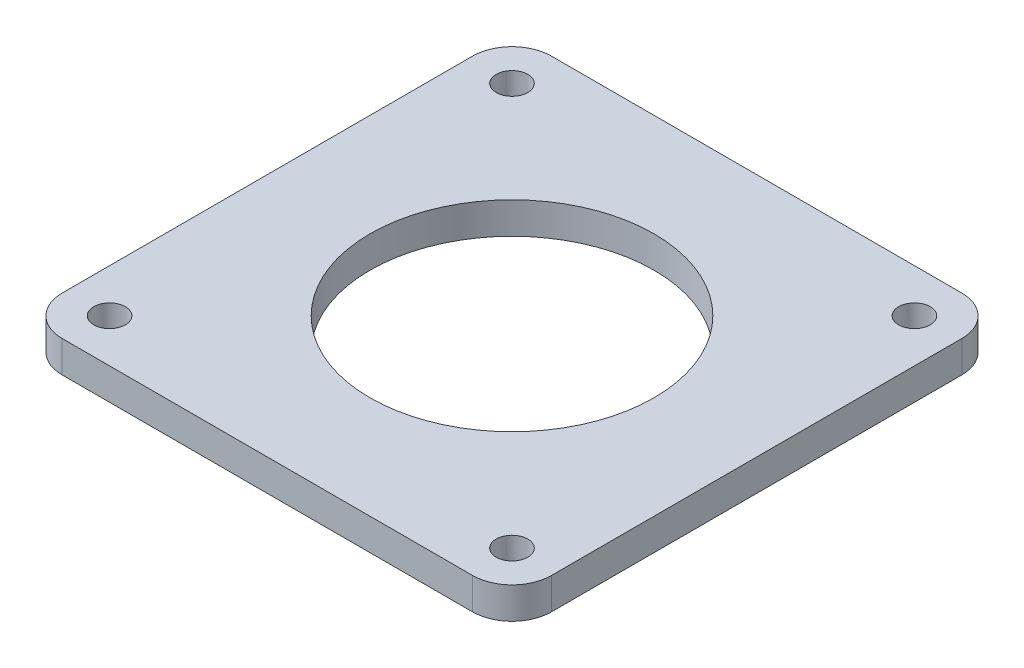
ISO-10303-21;
HEADER;
FILE_DESCRIPTION(('STEP AP214'),'2;1');
FILE_NAME('part.step','',(''),(''),'','','');
FILE_SCHEMA(('AUTOMOTIVE_DESIGN { 1 0 10303 214 1 1 1 1 }'));
ENDSEC;
DATA;
#1=APPLICATION_CONTEXT('core data for automotive mechanical design processes');
#2=APPLICATION_PROTOCOL_DEFINITION('international standard','automotive_design',2000,#1);
#3=PRODUCT_CONTEXT('',#1,'mechanical');
#4=PRODUCT('Part','Part','',(#3));
#5=PRODUCT_RELATED_PRODUCT_CATEGORY('part','',(#4));
#6=PRODUCT_DEFINITION_FORMATION('','',#4);
#7=PRODUCT_DEFINITION_CONTEXT('part definition',#1,'design');
#8=PRODUCT_DEFINITION('design','',#6,#7);
#9=PRODUCT_DEFINITION_SHAPE('','',#8);
#10=(LENGTH_UNIT() NAMED_UNIT(*) SI_UNIT(.MILLI.,.METRE.));
#11=(NAMED_UNIT(*) PLANE_ANGLE_UNIT() SI_UNIT($,.RADIAN.));
#12=(NAMED_UNIT(*) SI_UNIT($,.STERADIAN.) SOLID_ANGLE_UNIT());
#13=UNCERTAINTY_MEASURE_WITH_UNIT(LENGTH_MEASURE(1.E-05),#10,'distance_accuracy_value','');
#14=(GEOMETRIC_REPRESENTATION_CONTEXT(3) GLOBAL_UNCERTAINTY_ASSIGNED_CONTEXT((#13)) GLOBAL_UNIT_ASSIGNED_CONTEXT((#10,
#11,#12)) REPRESENTATION_CONTEXT('',''));
#15=CARTESIAN_POINT('',(0.,0.,0.));
#16=DIRECTION('',(0.,0.,1.));
#17=DIRECTION('',(1.,0.,0.));
#18=AXIS2_PLACEMENT_3D('',#15,#16,#17);
#19=CARTESIAN_POINT('',(0.,4.,31.));
#20=DIRECTION('',(0.,0.,-1.));
#21=DIRECTION('',(-1.,0.,0.));
#22=AXIS2_PLACEMENT_3D('',#19,#20,#21);
#23=PLANE('',#22);
#24=DIRECTION('',(1.,0.,0.));
#25=VECTOR('',#24,1.);
#26=CARTESIAN_POINT('',(0.,4.,31.));
#27=LINE('',#26,#25);
#28=CARTESIAN_POINT('',(-26.,4.,31.));
#29=VERTEX_POINT('',#28);
#30=CARTESIAN_POINT('',(26.,4.,31.));
#31=VERTEX_POINT('',#30);
#32=EDGE_CURVE('E124',#29,#31,#27,.T.);
#33=ORIENTED_EDGE('',*,*,#32,.F.);
#34=DIRECTION('',(0.,-1.,0.));
#35=VECTOR('',#34,1.);
#36=CARTESIAN_POINT('',(-26.,0.,31.));
#37=LINE('',#36,#35);
#38=CARTESIAN_POINT('',(-26.,0.,31.));
#39=VERTEX_POINT('',#38);
#40=EDGE_CURVE('E109',#29,#39,#37,.T.);
#41=ORIENTED_EDGE('',*,*,#40,.T.);
#42=DIRECTION('',(1.,0.,0.));
#43=VECTOR('',#42,1.);
#44=CARTESIAN_POINT('',(0.,0.,31.));
#45=LINE('',#44,#43);
#46=CARTESIAN_POINT('',(26.,0.,31.));
#47=VERTEX_POINT('',#46);
#48=EDGE_CURVE('E121',#39,#47,#45,.T.);
#49=ORIENTED_EDGE('',*,*,#48,.T.);
#50=DIRECTION('',(0.,-1.,0.));
#51=VECTOR('',#50,1.);
#52=CARTESIAN_POINT('',(26.,4.,31.));
#53=LINE('',#52,#51);
#54=EDGE_CURVE('E126',#47,#31,#53,.F.);
#55=ORIENTED_EDGE('',*,*,#54,.T.);
#56=EDGE_LOOP('',(#33,#41,#49,#55));
#57=FACE_BOUND('',#56,.T.);
#58=ADVANCED_FACE('F39',(#57),#23,.F.);
#59=CARTESIAN_POINT('',(31.,4.,0.));
#60=DIRECTION('',(-1.,0.,0.));
#61=DIRECTION('',(0.,0.,1.));
#62=AXIS2_PLACEMENT_3D('',#59,#60,#61);
#63=PLANE('',#62);
#64=DIRECTION('',(0.,0.,-1.));
#65=VECTOR('',#64,1.);
#66=CARTESIAN_POINT('',(31.,0.,0.));
#67=LINE('',#66,#65);
#68=CARTESIAN_POINT('',(31.,0.,26.));
#69=VERTEX_POINT('',#68);
#70=CARTESIAN_POINT('',(31.,0.,-26.));
#71=VERTEX_POINT('',#70);
#72=EDGE_CURVE('E131',#69,#71,#67,.T.);
#73=ORIENTED_EDGE('',*,*,#72,.T.);
#74=DIRECTION('',(0.,-1.,0.));
#75=VECTOR('',#74,1.);
#76=CARTESIAN_POINT('',(31.,4.,-26.));
#77=LINE('',#76,#75);
#78=CARTESIAN_POINT('',(31.,4.,-26.));
#79=VERTEX_POINT('',#78);
#80=EDGE_CURVE('E11',#71,#79,#77,.F.);
#81=ORIENTED_EDGE('',*,*,#80,.T.);
#82=DIRECTION('',(0.,0.,-1.));
#83=VECTOR('',#82,1.);
#84=CARTESIAN_POINT('',(31.,4.,0.));
#85=LINE('',#84,#83);
#86=CARTESIAN_POINT('',(31.,4.,26.));
#87=VERTEX_POINT('',#86);
#88=EDGE_CURVE('E182',#87,#79,#85,.T.);
#89=ORIENTED_EDGE('',*,*,#88,.F.);
#90=DIRECTION('',(0.,-1.,0.));
#91=VECTOR('',#90,1.);
#92=CARTESIAN_POINT('',(31.,4.,26.));
#93=LINE('',#92,#91);
#94=EDGE_CURVE('E47',#87,#69,#93,.T.);
#95=ORIENTED_EDGE('',*,*,#94,.T.);
#96=EDGE_LOOP('',(#73,#81,#89,#95));
#97=FACE_BOUND('',#96,.T.);
#98=ADVANCED_FACE('F180',(#97),#63,.F.);
#99=CARTESIAN_POINT('',(0.,4.,-31.));
#100=DIRECTION('',(0.,0.,-1.));
#101=DIRECTION('',(-1.,0.,0.));
#102=AXIS2_PLACEMENT_3D('',#99,#100,#101);
#103=PLANE('',#102);
#104=DIRECTION('',(1.,0.,0.));
#105=VECTOR('',#104,1.);
#106=CARTESIAN_POINT('',(0.,4.,-31.));
#107=LINE('',#106,#105);
#108=CARTESIAN_POINT('',(-26.,4.,-31.));
#109=VERTEX_POINT('',#108);
#110=CARTESIAN_POINT('',(26.,4.,-31.));
#111=VERTEX_POINT('',#110);
#112=EDGE_CURVE('E189',#109,#111,#107,.T.);
#113=ORIENTED_EDGE('',*,*,#112,.T.);
#114=DIRECTION('',(0.,-1.,0.));
#115=VECTOR('',#114,1.);
#116=CARTESIAN_POINT('',(26.,0.,-31.));
#117=LINE('',#116,#115);
#118=CARTESIAN_POINT('',(26.,0.,-31.));
#119=VERTEX_POINT('',#118);
#120=EDGE_CURVE('E174',#111,#119,#117,.T.);
#121=ORIENTED_EDGE('',*,*,#120,.T.);
#122=DIRECTION('',(1.,0.,0.));
#123=VECTOR('',#122,1.);
#124=CARTESIAN_POINT('',(0.,0.,-31.));
#125=LINE('',#124,#123);
#126=CARTESIAN_POINT('',(-26.,0.,-31.));
#127=VERTEX_POINT('',#126);
#128=EDGE_CURVE('E135',#127,#119,#125,.T.);
#129=ORIENTED_EDGE('',*,*,#128,.F.);
#130=DIRECTION('',(0.,-1.,0.));
#131=VECTOR('',#130,1.);
#132=CARTESIAN_POINT('',(-26.,4.,-31.));
#133=LINE('',#132,#131);
#134=EDGE_CURVE('E61',#127,#109,#133,.F.);
#135=ORIENTED_EDGE('',*,*,#134,.T.);
#136=EDGE_LOOP('',(#113,#121,#129,#135));
#137=FACE_BOUND('',#136,.T.);
#138=ADVANCED_FACE('F188',(#137),#103,.T.);
#139=CARTESIAN_POINT('',(25.5,4.,25.5));
#140=DIRECTION('',(0.,-1.,0.));
#141=DIRECTION('',(0.,0.,-1.));
#142=AXIS2_PLACEMENT_3D('',#139,#140,#141);
#143=CYLINDRICAL_SURFACE('',#142,2.);
#144=CARTESIAN_POINT('',(25.5,4.,25.5));
#145=DIRECTION('',(0.,1.,0.));
#146=DIRECTION('',(0.,0.,1.));
#147=AXIS2_PLACEMENT_3D('',#144,#145,#146);
#148=CIRCLE('',#147,2.);
#149=CARTESIAN_POINT('',(25.5,4.,27.5));
#150=VERTEX_POINT('',#149);
#151=EDGE_CURVE('E194',#150,#150,#148,.T.);
#152=ORIENTED_EDGE('',*,*,#151,.T.);
#153=EDGE_LOOP('',(#152));
#154=FACE_BOUND('',#153,.T.);
#155=CARTESIAN_POINT('',(25.5,0.,25.5));
#156=DIRECTION('',(0.,1.,0.));
#157=DIRECTION('',(0.,0.,1.));
#158=AXIS2_PLACEMENT_3D('',#155,#156,#157);
#159=CIRCLE('',#158,2.);
#160=CARTESIAN_POINT('',(25.5,0.,27.5));
#161=VERTEX_POINT('',#160);
#162=EDGE_CURVE('E146',#161,#161,#159,.T.);
#163=ORIENTED_EDGE('',*,*,#162,.F.);
#164=EDGE_LOOP('',(#163));
#165=FACE_BOUND('',#164,.T.);
#166=ADVANCED_FACE('F227',(#154,#165),#143,.F.);
#167=CARTESIAN_POINT('',(-31.,4.,0.));
#168=DIRECTION('',(-1.,0.,0.));
#169=DIRECTION('',(0.,0.,1.));
#170=AXIS2_PLACEMENT_3D('',#167,#168,#169);
#171=PLANE('',#170);
#172=DIRECTION('',(0.,0.,-1.));
#173=VECTOR('',#172,1.);
#174=CARTESIAN_POINT('',(-31.,0.,0.));
#175=LINE('',#174,#173);
#176=CARTESIAN_POINT('',(-31.,0.,26.));
#177=VERTEX_POINT('',#176);
#178=CARTESIAN_POINT('',(-31.,0.,-26.));
#179=VERTEX_POINT('',#178);
#180=EDGE_CURVE('E144',#177,#179,#175,.T.);
#181=ORIENTED_EDGE('',*,*,#180,.F.);
#182=DIRECTION('',(0.,-1.,0.));
#183=VECTOR('',#182,1.);
#184=CARTESIAN_POINT('',(-31.,4.,26.));
#185=LINE('',#184,#183);
#186=CARTESIAN_POINT('',(-31.,4.,26.));
#187=VERTEX_POINT('',#186);
#188=EDGE_CURVE('E110',#177,#187,#185,.F.);
#189=ORIENTED_EDGE('',*,*,#188,.T.);
#190=DIRECTION('',(0.,0.,-1.));
#191=VECTOR('',#190,1.);
#192=CARTESIAN_POINT('',(-31.,4.,0.));
#193=LINE('',#192,#191);
#194=CARTESIAN_POINT('',(-31.,4.,-26.));
#195=VERTEX_POINT('',#194);
#196=EDGE_CURVE('E191',#187,#195,#193,.T.);
#197=ORIENTED_EDGE('',*,*,#196,.T.);
#198=DIRECTION('',(0.,-1.,0.));
#199=VECTOR('',#198,1.);
#200=CARTESIAN_POINT('',(-31.,4.,-26.));
#201=LINE('',#200,#199);
#202=EDGE_CURVE('E115',#195,#179,#201,.T.);
#203=ORIENTED_EDGE('',*,*,#202,.T.);
#204=EDGE_LOOP('',(#181,#189,#197,#203));
#205=FACE_BOUND('',#204,.T.);
#206=ADVANCED_FACE('F217',(#205),#171,.T.);
#207=CARTESIAN_POINT('',(-25.5,4.,-25.5));
#208=DIRECTION('',(0.,-1.,0.));
#209=DIRECTION('',(0.,0.,-1.));
#210=AXIS2_PLACEMENT_3D('',#207,#208,#209);
#211=CYLINDRICAL_SURFACE('',#210,2.);
#212=CARTESIAN_POINT('',(-25.5,4.,-25.5));
#213=DIRECTION('',(0.,1.,0.));
#214=DIRECTION('',(0.,0.,1.));
#215=AXIS2_PLACEMENT_3D('',#212,#213,#214);
#216=CIRCLE('',#215,2.);
#217=CARTESIAN_POINT('',(-25.5,4.,-23.5));
#218=VERTEX_POINT('',#217);
#219=EDGE_CURVE('E263',#218,#218,#216,.T.);
#220=ORIENTED_EDGE('',*,*,#219,.T.);
#221=EDGE_LOOP('',(#220));
#222=FACE_BOUND('',#221,.T.);
#223=CARTESIAN_POINT('',(-25.5,0.,-25.5));
#224=DIRECTION('',(0.,1.,0.));
#225=DIRECTION('',(0.,0.,1.));
#226=AXIS2_PLACEMENT_3D('',#223,#224,#225);
#227=CIRCLE('',#226,2.);
#228=CARTESIAN_POINT('',(-25.5,0.,-23.5));
#229=VERTEX_POINT('',#228);
#230=EDGE_CURVE('E132',#229,#229,#227,.T.);
#231=ORIENTED_EDGE('',*,*,#230,.F.);
#232=EDGE_LOOP('',(#231));
#233=FACE_BOUND('',#232,.T.);
#234=ADVANCED_FACE('F215',(#222,#233),#211,.F.);
#235=CARTESIAN_POINT('',(25.5,4.,-25.5));
#236=DIRECTION('',(0.,-1.,0.));
#237=DIRECTION('',(0.,0.,-1.));
#238=AXIS2_PLACEMENT_3D('',#235,#236,#237);
#239=CYLINDRICAL_SURFACE('',#238,2.);
#240=CARTESIAN_POINT('',(25.5,4.,-25.5));
#241=DIRECTION('',(0.,1.,0.));
#242=DIRECTION('',(0.,0.,1.));
#243=AXIS2_PLACEMENT_3D('',#240,#241,#242);
#244=CIRCLE('',#243,2.);
#245=CARTESIAN_POINT('',(25.5,4.,-23.5));
#246=VERTEX_POINT('',#245);
#247=EDGE_CURVE('E152',#246,#246,#244,.F.);
#248=ORIENTED_EDGE('',*,*,#247,.F.);
#249=EDGE_LOOP('',(#248));
#250=FACE_BOUND('',#249,.T.);
#251=CARTESIAN_POINT('',(25.5,0.,-25.5));
#252=DIRECTION('',(0.,1.,0.));
#253=DIRECTION('',(0.,0.,1.));
#254=AXIS2_PLACEMENT_3D('',#251,#252,#253);
#255=CIRCLE('',#254,2.);
#256=CARTESIAN_POINT('',(25.5,0.,-23.5));
#257=VERTEX_POINT('',#256);
#258=EDGE_CURVE('E138',#257,#257,#255,.F.);
#259=ORIENTED_EDGE('',*,*,#258,.T.);
#260=EDGE_LOOP('',(#259));
#261=FACE_BOUND('',#260,.T.);
#262=ADVANCED_FACE('F205',(#250,#261),#239,.F.);
#263=CARTESIAN_POINT('',(-25.5,4.,25.5));
#264=DIRECTION('',(0.,-1.,0.));
#265=DIRECTION('',(0.,0.,-1.));
#266=AXIS2_PLACEMENT_3D('',#263,#264,#265);
#267=CYLINDRICAL_SURFACE('',#266,2.);
#268=CARTESIAN_POINT('',(-25.5,4.,25.5));
#269=DIRECTION('',(0.,1.,0.));
#270=DIRECTION('',(0.,0.,1.));
#271=AXIS2_PLACEMENT_3D('',#268,#269,#270);
#272=CIRCLE('',#271,2.);
#273=CARTESIAN_POINT('',(-25.5,4.,27.5));
#274=VERTEX_POINT('',#273);
#275=EDGE_CURVE('E157',#274,#274,#272,.F.);
#276=ORIENTED_EDGE('',*,*,#275,.F.);
#277=EDGE_LOOP('',(#276));
#278=FACE_BOUND('',#277,.T.);
#279=CARTESIAN_POINT('',(-25.5,0.,25.5));
#280=DIRECTION('',(0.,1.,0.));
#281=DIRECTION('',(0.,0.,1.));
#282=AXIS2_PLACEMENT_3D('',#279,#280,#281);
#283=CIRCLE('',#282,2.);
#284=CARTESIAN_POINT('',(-25.5,0.,27.5));
#285=VERTEX_POINT('',#284);
#286=EDGE_CURVE('E149',#285,#285,#283,.F.);
#287=ORIENTED_EDGE('',*,*,#286,.T.);
#288=EDGE_LOOP('',(#287));
#289=FACE_BOUND('',#288,.T.);
#290=ADVANCED_FACE('F224',(#278,#289),#267,.F.);
#291=CARTESIAN_POINT('',(0.,4.,0.));
#292=DIRECTION('',(0.,1.,0.));
#293=DIRECTION('',(0.,0.,1.));
#294=AXIS2_PLACEMENT_3D('',#291,#292,#293);
#295=PLANE('',#294);
#296=CARTESIAN_POINT('',(0.,4.,0.));
#297=DIRECTION('',(0.,1.,0.));
#298=DIRECTION('',(0.,0.,1.));
#299=AXIS2_PLACEMENT_3D('',#296,#297,#298);
#300=CIRCLE('',#299,18.);
#301=CARTESIAN_POINT('',(0.,4.,18.));
#302=VERTEX_POINT('',#301);
#303=EDGE_CURVE('E156',#302,#302,#300,.T.);
#304=ORIENTED_EDGE('',*,*,#303,.F.);
#305=EDGE_LOOP('',(#304));
#306=FACE_BOUND('',#305,.T.);
#307=ORIENTED_EDGE('',*,*,#247,.T.);
#308=EDGE_LOOP('',(#307));
#309=FACE_BOUND('',#308,.T.);
#310=ORIENTED_EDGE('',*,*,#219,.F.);
#311=EDGE_LOOP('',(#310));
#312=FACE_BOUND('',#311,.T.);
#313=ORIENTED_EDGE('',*,*,#196,.F.);
#314=CARTESIAN_POINT('',(-26.,4.,26.));
#315=DIRECTION('',(0.,1.,0.));
#316=DIRECTION('',(0.,0.,1.));
#317=AXIS2_PLACEMENT_3D('',#314,#315,#316);
#318=CIRCLE('',#317,5.);
#319=EDGE_CURVE('E171',#187,#29,#318,.T.);
#320=ORIENTED_EDGE('',*,*,#319,.T.);
#321=ORIENTED_EDGE('',*,*,#32,.T.);
#322=CARTESIAN_POINT('',(26.,4.,26.));
#323=DIRECTION('',(0.,1.,0.));
#324=DIRECTION('',(0.,0.,1.));
#325=AXIS2_PLACEMENT_3D('',#322,#323,#324);
#326=CIRCLE('',#325,5.);
#327=EDGE_CURVE('E166',#31,#87,#326,.T.);
#328=ORIENTED_EDGE('',*,*,#327,.T.);
#329=ORIENTED_EDGE('',*,*,#88,.T.);
#330=CARTESIAN_POINT('',(26.,4.,-26.));
#331=DIRECTION('',(0.,1.,0.));
#332=DIRECTION('',(0.,0.,1.));
#333=AXIS2_PLACEMENT_3D('',#330,#331,#332);
#334=CIRCLE('',#333,5.);
#335=EDGE_CURVE('E54',#79,#111,#334,.T.);
#336=ORIENTED_EDGE('',*,*,#335,.T.);
#337=ORIENTED_EDGE('',*,*,#112,.F.);
#338=CARTESIAN_POINT('',(-26.,4.,-26.));
#339=DIRECTION('',(0.,1.,0.));
#340=DIRECTION('',(0.,0.,1.));
#341=AXIS2_PLACEMENT_3D('',#338,#339,#340);
#342=CIRCLE('',#341,5.);
#343=EDGE_CURVE('E168',#109,#195,#342,.T.);
#344=ORIENTED_EDGE('',*,*,#343,.T.);
#345=EDGE_LOOP('',(#313,#320,#321,#328,#329,#336,#337,#344));
#346=FACE_BOUND('',#345,.T.);
#347=ORIENTED_EDGE('',*,*,#151,.F.);
#348=EDGE_LOOP('',(#347));
#349=FACE_BOUND('',#348,.T.);
#350=ORIENTED_EDGE('',*,*,#275,.T.);
#351=EDGE_LOOP('',(#350));
#352=FACE_BOUND('',#351,.T.);
#353=ADVANCED_FACE('F210',(#306,#309,#312,#346,#349,#352),#295,.T.);
#354=CARTESIAN_POINT('',(0.,0.,0.));
#355=DIRECTION('',(0.,1.,0.));
#356=DIRECTION('',(0.,0.,1.));
#357=AXIS2_PLACEMENT_3D('',#354,#355,#356);
#358=PLANE('',#357);
#359=CARTESIAN_POINT('',(0.,0.,0.));
#360=DIRECTION('',(0.,1.,0.));
#361=DIRECTION('',(0.,0.,1.));
#362=AXIS2_PLACEMENT_3D('',#359,#360,#361);
#363=CIRCLE('',#362,18.);
#364=CARTESIAN_POINT('',(0.,0.,18.));
#365=VERTEX_POINT('',#364);
#366=EDGE_CURVE('E153',#365,#365,#363,.T.);
#367=ORIENTED_EDGE('',*,*,#366,.T.);
#368=EDGE_LOOP('',(#367));
#369=FACE_BOUND('',#368,.T.);
#370=ORIENTED_EDGE('',*,*,#258,.F.);
#371=EDGE_LOOP('',(#370));
#372=FACE_BOUND('',#371,.T.);
#373=ORIENTED_EDGE('',*,*,#230,.T.);
#374=EDGE_LOOP('',(#373));
#375=FACE_BOUND('',#374,.T.);
#376=ORIENTED_EDGE('',*,*,#48,.F.);
#377=CARTESIAN_POINT('',(-26.,0.,26.));
#378=DIRECTION('',(0.,1.,0.));
#379=DIRECTION('',(0.,0.,1.));
#380=AXIS2_PLACEMENT_3D('',#377,#378,#379);
#381=CIRCLE('',#380,5.);
#382=EDGE_CURVE('E105',#39,#177,#381,.F.);
#383=ORIENTED_EDGE('',*,*,#382,.T.);
#384=ORIENTED_EDGE('',*,*,#180,.T.);
#385=CARTESIAN_POINT('',(-26.,0.,-26.));
#386=DIRECTION('',(0.,1.,0.));
#387=DIRECTION('',(0.,0.,1.));
#388=AXIS2_PLACEMENT_3D('',#385,#386,#387);
#389=CIRCLE('',#388,5.);
#390=EDGE_CURVE('E160',#179,#127,#389,.F.);
#391=ORIENTED_EDGE('',*,*,#390,.T.);
#392=ORIENTED_EDGE('',*,*,#128,.T.);
#393=CARTESIAN_POINT('',(26.,0.,-26.));
#394=DIRECTION('',(0.,1.,0.));
#395=DIRECTION('',(0.,0.,1.));
#396=AXIS2_PLACEMENT_3D('',#393,#394,#395);
#397=CIRCLE('',#396,5.);
#398=EDGE_CURVE('E116',#119,#71,#397,.F.);
#399=ORIENTED_EDGE('',*,*,#398,.T.);
#400=ORIENTED_EDGE('',*,*,#72,.F.);
#401=CARTESIAN_POINT('',(26.,0.,26.));
#402=DIRECTION('',(0.,1.,0.));
#403=DIRECTION('',(0.,0.,1.));
#404=AXIS2_PLACEMENT_3D('',#401,#402,#403);
#405=CIRCLE('',#404,5.);
#406=EDGE_CURVE('E125',#69,#47,#405,.F.);
#407=ORIENTED_EDGE('',*,*,#406,.T.);
#408=EDGE_LOOP('',(#376,#383,#384,#391,#392,#399,#400,#407));
#409=FACE_BOUND('',#408,.T.);
#410=ORIENTED_EDGE('',*,*,#162,.T.);
#411=EDGE_LOOP('',(#410));
#412=FACE_BOUND('',#411,.T.);
#413=ORIENTED_EDGE('',*,*,#286,.F.);
#414=EDGE_LOOP('',(#413));
#415=FACE_BOUND('',#414,.T.);
#416=ADVANCED_FACE('F128',(#369,#372,#375,#409,#412,#415),#358,.F.);
#417=CARTESIAN_POINT('',(0.,-6.,0.));
#418=DIRECTION('',(0.,1.,0.));
#419=DIRECTION('',(0.,0.,1.));
#420=AXIS2_PLACEMENT_3D('',#417,#418,#419);
#421=CYLINDRICAL_SURFACE('',#420,18.);
#422=ORIENTED_EDGE('',*,*,#303,.T.);
#423=EDGE_LOOP('',(#422));
#424=FACE_BOUND('',#423,.T.);
#425=ORIENTED_EDGE('',*,*,#366,.F.);
#426=EDGE_LOOP('',(#425));
#427=FACE_BOUND('',#426,.T.);
#428=ADVANCED_FACE('F209',(#424,#427),#421,.F.);
#429=CARTESIAN_POINT('',(-26.,4.,26.));
#430=DIRECTION('',(0.,1.,0.));
#431=DIRECTION('',(0.,0.,1.));
#432=AXIS2_PLACEMENT_3D('',#429,#430,#431);
#433=CYLINDRICAL_SURFACE('',#432,5.);
#434=ORIENTED_EDGE('',*,*,#319,.F.);
#435=ORIENTED_EDGE('',*,*,#188,.F.);
#436=ORIENTED_EDGE('',*,*,#382,.F.);
#437=ORIENTED_EDGE('',*,*,#40,.F.);
#438=EDGE_LOOP('',(#434,#435,#436,#437));
#439=FACE_BOUND('',#438,.T.);
#440=ADVANCED_FACE('F108',(#439),#433,.T.);
#441=CARTESIAN_POINT('',(26.,4.,-26.));
#442=DIRECTION('',(0.,1.,0.));
#443=DIRECTION('',(0.,0.,1.));
#444=AXIS2_PLACEMENT_3D('',#441,#442,#443);
#445=CYLINDRICAL_SURFACE('',#444,5.);
#446=ORIENTED_EDGE('',*,*,#335,.F.);
#447=ORIENTED_EDGE('',*,*,#80,.F.);
#448=ORIENTED_EDGE('',*,*,#398,.F.);
#449=ORIENTED_EDGE('',*,*,#120,.F.);
#450=EDGE_LOOP('',(#446,#447,#448,#449));
#451=FACE_BOUND('',#450,.T.);
#452=ADVANCED_FACE('F187',(#451),#445,.T.);
#453=CARTESIAN_POINT('',(-26.,4.,-26.));
#454=DIRECTION('',(0.,-1.,0.));
#455=DIRECTION('',(0.,0.,-1.));
#456=AXIS2_PLACEMENT_3D('',#453,#454,#455);
#457=CYLINDRICAL_SURFACE('',#456,5.);
#458=ORIENTED_EDGE('',*,*,#343,.F.);
#459=ORIENTED_EDGE('',*,*,#134,.F.);
#460=ORIENTED_EDGE('',*,*,#390,.F.);
#461=ORIENTED_EDGE('',*,*,#202,.F.);
#462=EDGE_LOOP('',(#458,#459,#460,#461));
#463=FACE_BOUND('',#462,.T.);
#464=ADVANCED_FACE('F267',(#463),#457,.T.);
#465=CARTESIAN_POINT('',(26.,4.,26.));
#466=DIRECTION('',(0.,-1.,0.));
#467=DIRECTION('',(0.,0.,-1.));
#468=AXIS2_PLACEMENT_3D('',#465,#466,#467);
#469=CYLINDRICAL_SURFACE('',#468,5.);
#470=ORIENTED_EDGE('',*,*,#327,.F.);
#471=ORIENTED_EDGE('',*,*,#54,.F.);
#472=ORIENTED_EDGE('',*,*,#406,.F.);
#473=ORIENTED_EDGE('',*,*,#94,.F.);
#474=EDGE_LOOP('',(#470,#471,#472,#473));
#475=FACE_BOUND('',#474,.T.);
#476=ADVANCED_FACE('F41',(#475),#469,.T.);
#477=CLOSED_SHELL('',(#58,#98,#138,#166,#206,#234,#262,#290,#353,#416,#428,#440,#452,#464,#476));
#478=MANIFOLD_SOLID_BREP('B2',#477);
#479=ADVANCED_BREP_SHAPE_REPRESENTATION('',(#18,#478),#14);
#480=SHAPE_DEFINITION_REPRESENTATION(#9,#479);
ENDSEC;
END-ISO-10303-21;
